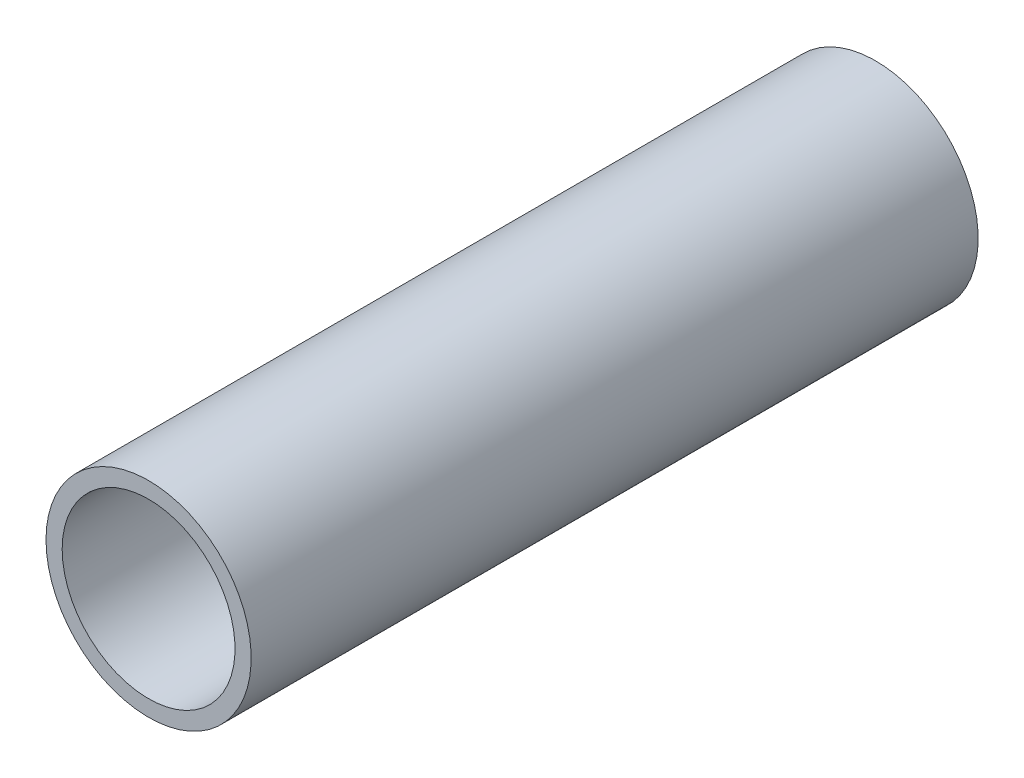
ISO-10303-21;
HEADER;
FILE_DESCRIPTION(('STEP AP214'),'2;1');
FILE_NAME('part.step','',(''),(''),'','','');
FILE_SCHEMA(('AUTOMOTIVE_DESIGN { 1 0 10303 214 1 1 1 1 }'));
ENDSEC;
DATA;
#1=APPLICATION_CONTEXT('core data for automotive mechanical design processes');
#2=APPLICATION_PROTOCOL_DEFINITION('international standard','automotive_design',2000,#1);
#3=PRODUCT_CONTEXT('',#1,'mechanical');
#4=PRODUCT('Part','Part','',(#3));
#5=PRODUCT_RELATED_PRODUCT_CATEGORY('part','',(#4));
#6=PRODUCT_DEFINITION_FORMATION('','',#4);
#7=PRODUCT_DEFINITION_CONTEXT('part definition',#1,'design');
#8=PRODUCT_DEFINITION('design','',#6,#7);
#9=PRODUCT_DEFINITION_SHAPE('','',#8);
#10=(LENGTH_UNIT() NAMED_UNIT(*) SI_UNIT(.MILLI.,.METRE.));
#11=(NAMED_UNIT(*) PLANE_ANGLE_UNIT() SI_UNIT($,.RADIAN.));
#12=(NAMED_UNIT(*) SI_UNIT($,.STERADIAN.) SOLID_ANGLE_UNIT());
#13=UNCERTAINTY_MEASURE_WITH_UNIT(LENGTH_MEASURE(1.E-05),#10,'distance_accuracy_value','');
#14=(GEOMETRIC_REPRESENTATION_CONTEXT(3) GLOBAL_UNCERTAINTY_ASSIGNED_CONTEXT((#13)) GLOBAL_UNIT_ASSIGNED_CONTEXT((#10,
#11,#12)) REPRESENTATION_CONTEXT('',''));
#15=CARTESIAN_POINT('',(0.,0.,0.));
#16=DIRECTION('',(0.,0.,1.));
#17=DIRECTION('',(1.,0.,0.));
#18=AXIS2_PLACEMENT_3D('',#15,#16,#17);
#19=CARTESIAN_POINT('',(0.,0.,-90.));
#20=DIRECTION('',(0.,0.,-1.));
#21=DIRECTION('',(1.,0.,0.));
#22=AXIS2_PLACEMENT_3D('',#19,#20,#21);
#23=PLANE('',#22);
#24=CARTESIAN_POINT('',(0.,0.,-90.));
#25=DIRECTION('',(0.,0.,1.));
#26=DIRECTION('',(1.,0.,0.));
#27=AXIS2_PLACEMENT_3D('',#24,#25,#26);
#28=CIRCLE('',#27,12.7);
#29=CARTESIAN_POINT('',(-12.7,0.,-90.));
#30=VERTEX_POINT('',#29);
#31=EDGE_CURVE('E10',#30,#30,#28,.T.);
#32=ORIENTED_EDGE('',*,*,#31,.F.);
#33=EDGE_LOOP('',(#32));
#34=FACE_BOUND('',#33,.T.);
#35=CARTESIAN_POINT('',(0.,0.,-90.));
#36=DIRECTION('',(0.,0.,1.));
#37=DIRECTION('',(1.,0.,0.));
#38=AXIS2_PLACEMENT_3D('',#35,#36,#37);
#39=CIRCLE('',#38,10.7);
#40=CARTESIAN_POINT('',(-10.7,0.,-90.));
#41=VERTEX_POINT('',#40);
#42=EDGE_CURVE('E44',#41,#41,#39,.T.);
#43=ORIENTED_EDGE('',*,*,#42,.T.);
#44=EDGE_LOOP('',(#43));
#45=FACE_BOUND('',#44,.T.);
#46=ADVANCED_FACE('F33',(#34,#45),#23,.T.);
#47=CARTESIAN_POINT('',(0.,0.,0.));
#48=DIRECTION('',(0.,0.,-1.));
#49=DIRECTION('',(1.,0.,0.));
#50=AXIS2_PLACEMENT_3D('',#47,#48,#49);
#51=PLANE('',#50);
#52=CARTESIAN_POINT('',(0.,0.,0.));
#53=DIRECTION('',(0.,0.,1.));
#54=DIRECTION('',(1.,0.,0.));
#55=AXIS2_PLACEMENT_3D('',#52,#53,#54);
#56=CIRCLE('',#55,12.7);
#57=CARTESIAN_POINT('',(-12.7,0.,0.));
#58=VERTEX_POINT('',#57);
#59=EDGE_CURVE('E37',#58,#58,#56,.T.);
#60=ORIENTED_EDGE('',*,*,#59,.T.);
#61=EDGE_LOOP('',(#60));
#62=FACE_BOUND('',#61,.T.);
#63=CARTESIAN_POINT('',(0.,0.,0.));
#64=DIRECTION('',(0.,0.,1.));
#65=DIRECTION('',(1.,0.,0.));
#66=AXIS2_PLACEMENT_3D('',#63,#64,#65);
#67=CIRCLE('',#66,10.7);
#68=CARTESIAN_POINT('',(-10.7,0.,0.));
#69=VERTEX_POINT('',#68);
#70=EDGE_CURVE('E46',#69,#69,#67,.T.);
#71=ORIENTED_EDGE('',*,*,#70,.F.);
#72=EDGE_LOOP('',(#71));
#73=FACE_BOUND('',#72,.T.);
#74=ADVANCED_FACE('F59',(#62,#73),#51,.F.);
#75=CARTESIAN_POINT('',(0.,0.,-90.));
#76=DIRECTION('',(0.,0.,1.));
#77=DIRECTION('',(-1.,0.,0.));
#78=AXIS2_PLACEMENT_3D('',#75,#76,#77);
#79=CYLINDRICAL_SURFACE('',#78,12.7);
#80=CARTESIAN_POINT('',(-12.7,0.,-90.));
#81=CARTESIAN_POINT('',(-12.7,0.,-89.0625));
#82=CARTESIAN_POINT('',(-12.7,0.,-88.125));
#83=CARTESIAN_POINT('',(-12.7,0.,-86.25));
#84=CARTESIAN_POINT('',(-12.7,0.,-85.3125));
#85=CARTESIAN_POINT('',(-12.7,0.,-83.4375));
#86=CARTESIAN_POINT('',(-12.7,0.,-82.5));
#87=CARTESIAN_POINT('',(-12.7,0.,-80.625));
#88=CARTESIAN_POINT('',(-12.7,0.,-79.6875));
#89=CARTESIAN_POINT('',(-12.7,0.,-77.8125));
#90=CARTESIAN_POINT('',(-12.7,0.,-76.875));
#91=CARTESIAN_POINT('',(-12.7,0.,-75.));
#92=CARTESIAN_POINT('',(-12.7,0.,-74.0625));
#93=CARTESIAN_POINT('',(-12.7,0.,-72.1875));
#94=CARTESIAN_POINT('',(-12.7,0.,-71.25));
#95=CARTESIAN_POINT('',(-12.7,0.,-69.375));
#96=CARTESIAN_POINT('',(-12.7,0.,-68.4375));
#97=CARTESIAN_POINT('',(-12.7,0.,-66.5625));
#98=CARTESIAN_POINT('',(-12.7,0.,-65.625));
#99=CARTESIAN_POINT('',(-12.7,0.,-63.75));
#100=CARTESIAN_POINT('',(-12.7,0.,-62.8125));
#101=CARTESIAN_POINT('',(-12.7,0.,-60.9375));
#102=CARTESIAN_POINT('',(-12.7,0.,-60.));
#103=CARTESIAN_POINT('',(-12.7,0.,-58.125));
#104=CARTESIAN_POINT('',(-12.7,0.,-57.1875));
#105=CARTESIAN_POINT('',(-12.7,0.,-55.3125));
#106=CARTESIAN_POINT('',(-12.7,0.,-54.375));
#107=CARTESIAN_POINT('',(-12.7,0.,-52.5));
#108=CARTESIAN_POINT('',(-12.7,0.,-51.5625));
#109=CARTESIAN_POINT('',(-12.7,0.,-49.6875));
#110=CARTESIAN_POINT('',(-12.7,0.,-48.75));
#111=CARTESIAN_POINT('',(-12.7,0.,-46.875));
#112=CARTESIAN_POINT('',(-12.7,0.,-45.9375));
#113=CARTESIAN_POINT('',(-12.7,0.,-44.0625));
#114=CARTESIAN_POINT('',(-12.7,0.,-43.125));
#115=CARTESIAN_POINT('',(-12.7,0.,-41.25));
#116=CARTESIAN_POINT('',(-12.7,0.,-40.3125));
#117=CARTESIAN_POINT('',(-12.7,0.,-38.4375));
#118=CARTESIAN_POINT('',(-12.7,0.,-37.5));
#119=CARTESIAN_POINT('',(-12.7,0.,-35.625));
#120=CARTESIAN_POINT('',(-12.7,0.,-34.6875));
#121=CARTESIAN_POINT('',(-12.7,0.,-32.8125));
#122=CARTESIAN_POINT('',(-12.7,0.,-31.875));
#123=CARTESIAN_POINT('',(-12.7,0.,-30.));
#124=CARTESIAN_POINT('',(-12.7,0.,-29.0625));
#125=CARTESIAN_POINT('',(-12.7,0.,-27.1875));
#126=CARTESIAN_POINT('',(-12.7,0.,-26.25));
#127=CARTESIAN_POINT('',(-12.7,0.,-24.375));
#128=CARTESIAN_POINT('',(-12.7,0.,-23.4375));
#129=CARTESIAN_POINT('',(-12.7,0.,-21.5625));
#130=CARTESIAN_POINT('',(-12.7,0.,-20.625));
#131=CARTESIAN_POINT('',(-12.7,0.,-18.75));
#132=CARTESIAN_POINT('',(-12.7,0.,-17.8125));
#133=CARTESIAN_POINT('',(-12.7,0.,-15.9375));
#134=CARTESIAN_POINT('',(-12.7,0.,-15.));
#135=CARTESIAN_POINT('',(-12.7,0.,-13.125));
#136=CARTESIAN_POINT('',(-12.7,0.,-12.1875));
#137=CARTESIAN_POINT('',(-12.7,0.,-10.3125));
#138=CARTESIAN_POINT('',(-12.7,0.,-9.37500000000001));
#139=CARTESIAN_POINT('',(-12.7,0.,-7.50000000000002));
#140=CARTESIAN_POINT('',(-12.7,0.,-6.56250000000002));
#141=CARTESIAN_POINT('',(-12.7,0.,-4.68750000000002));
#142=CARTESIAN_POINT('',(-12.7,0.,-3.75000000000001));
#143=CARTESIAN_POINT('',(-12.7,0.,-1.87500000000001));
#144=CARTESIAN_POINT('',(-12.7,0.,-0.937500000000014));
#145=CARTESIAN_POINT('',(-12.7,0.,0.));
#146=B_SPLINE_CURVE_WITH_KNOTS('',3,(#80,#81,#82,#83,#84,#85,#86,#87,#88,#89,#90,#91,#92,#93,
#94,#95,#96,#97,#98,#99,#100,#101,#102,#103,#104,#105,#106,#107,#108,#109,#110,#111,#112,#113,
#114,#115,#116,#117,#118,#119,#120,#121,#122,#123,#124,#125,#126,#127,#128,#129,#130,#131,#132,
#133,#134,#135,#136,#137,#138,#139,#140,#141,#142,#143,#144,#145),.UNSPECIFIED.,.F.,.F.,(4,2,2,
2,2,2,2,2,2,2,2,2,2,2,2,2,2,2,2,2,2,2,2,2,2,2,2,2,2,2,2,2,4),(0.,2.8125,5.62499999999999,
8.43749999999999,11.25,14.0625,16.875,19.6875,22.5,25.3125,28.125,30.9375,33.75,36.5625,39.375,
42.1875,45.,47.8125,50.625,53.4375,56.25,59.0625,61.875,64.6875,67.5,70.3125,73.125,75.9375,
78.75,81.5625,84.375,87.1875,90.),.UNSPECIFIED.);
#147=EDGE_CURVE('BSEAM35',#30,#58,#146,.T.);
#148=ORIENTED_EDGE('',*,*,#31,.T.);
#149=ORIENTED_EDGE('',*,*,#59,.F.);
#150=ORIENTED_EDGE('',*,*,#147,.T.);
#151=ORIENTED_EDGE('',*,*,#147,.F.);
#152=EDGE_LOOP('',(#148,#150,#149,#151));
#153=FACE_BOUND('',#152,.T.);
#154=ADVANCED_FACE('F35',(#153),#79,.T.);
#155=CARTESIAN_POINT('',(0.,0.,-90.));
#156=DIRECTION('',(0.,0.,1.));
#157=DIRECTION('',(-1.,0.,0.));
#158=AXIS2_PLACEMENT_3D('',#155,#156,#157);
#159=CYLINDRICAL_SURFACE('',#158,10.7);
#160=CARTESIAN_POINT('',(-10.7,0.,-90.));
#161=CARTESIAN_POINT('',(-10.7,0.,-89.0625));
#162=CARTESIAN_POINT('',(-10.7,0.,-88.125));
#163=CARTESIAN_POINT('',(-10.7,0.,-86.25));
#164=CARTESIAN_POINT('',(-10.7,0.,-85.3125));
#165=CARTESIAN_POINT('',(-10.7,0.,-83.4375));
#166=CARTESIAN_POINT('',(-10.7,0.,-82.5));
#167=CARTESIAN_POINT('',(-10.7,0.,-80.625));
#168=CARTESIAN_POINT('',(-10.7,0.,-79.6875));
#169=CARTESIAN_POINT('',(-10.7,0.,-77.8125));
#170=CARTESIAN_POINT('',(-10.7,0.,-76.875));
#171=CARTESIAN_POINT('',(-10.7,0.,-75.));
#172=CARTESIAN_POINT('',(-10.7,0.,-74.0625));
#173=CARTESIAN_POINT('',(-10.7,0.,-72.1875));
#174=CARTESIAN_POINT('',(-10.7,0.,-71.25));
#175=CARTESIAN_POINT('',(-10.7,0.,-69.375));
#176=CARTESIAN_POINT('',(-10.7,0.,-68.4375));
#177=CARTESIAN_POINT('',(-10.7,0.,-66.5625));
#178=CARTESIAN_POINT('',(-10.7,0.,-65.625));
#179=CARTESIAN_POINT('',(-10.7,0.,-63.75));
#180=CARTESIAN_POINT('',(-10.7,0.,-62.8125));
#181=CARTESIAN_POINT('',(-10.7,0.,-60.9375));
#182=CARTESIAN_POINT('',(-10.7,0.,-60.));
#183=CARTESIAN_POINT('',(-10.7,0.,-58.125));
#184=CARTESIAN_POINT('',(-10.7,0.,-57.1875));
#185=CARTESIAN_POINT('',(-10.7,0.,-55.3125));
#186=CARTESIAN_POINT('',(-10.7,0.,-54.375));
#187=CARTESIAN_POINT('',(-10.7,0.,-52.5));
#188=CARTESIAN_POINT('',(-10.7,0.,-51.5625));
#189=CARTESIAN_POINT('',(-10.7,0.,-49.6875));
#190=CARTESIAN_POINT('',(-10.7,0.,-48.75));
#191=CARTESIAN_POINT('',(-10.7,0.,-46.875));
#192=CARTESIAN_POINT('',(-10.7,0.,-45.9375));
#193=CARTESIAN_POINT('',(-10.7,0.,-44.0625));
#194=CARTESIAN_POINT('',(-10.7,0.,-43.125));
#195=CARTESIAN_POINT('',(-10.7,0.,-41.25));
#196=CARTESIAN_POINT('',(-10.7,0.,-40.3125));
#197=CARTESIAN_POINT('',(-10.7,0.,-38.4375));
#198=CARTESIAN_POINT('',(-10.7,0.,-37.5));
#199=CARTESIAN_POINT('',(-10.7,0.,-35.625));
#200=CARTESIAN_POINT('',(-10.7,0.,-34.6875));
#201=CARTESIAN_POINT('',(-10.7,0.,-32.8125));
#202=CARTESIAN_POINT('',(-10.7,0.,-31.875));
#203=CARTESIAN_POINT('',(-10.7,0.,-30.));
#204=CARTESIAN_POINT('',(-10.7,0.,-29.0625));
#205=CARTESIAN_POINT('',(-10.7,0.,-27.1875));
#206=CARTESIAN_POINT('',(-10.7,0.,-26.25));
#207=CARTESIAN_POINT('',(-10.7,0.,-24.375));
#208=CARTESIAN_POINT('',(-10.7,0.,-23.4375));
#209=CARTESIAN_POINT('',(-10.7,0.,-21.5625));
#210=CARTESIAN_POINT('',(-10.7,0.,-20.625));
#211=CARTESIAN_POINT('',(-10.7,0.,-18.75));
#212=CARTESIAN_POINT('',(-10.7,0.,-17.8125));
#213=CARTESIAN_POINT('',(-10.7,0.,-15.9375));
#214=CARTESIAN_POINT('',(-10.7,0.,-15.));
#215=CARTESIAN_POINT('',(-10.7,0.,-13.125));
#216=CARTESIAN_POINT('',(-10.7,0.,-12.1875));
#217=CARTESIAN_POINT('',(-10.7,0.,-10.3125));
#218=CARTESIAN_POINT('',(-10.7,0.,-9.37500000000001));
#219=CARTESIAN_POINT('',(-10.7,0.,-7.50000000000002));
#220=CARTESIAN_POINT('',(-10.7,0.,-6.56250000000002));
#221=CARTESIAN_POINT('',(-10.7,0.,-4.68750000000002));
#222=CARTESIAN_POINT('',(-10.7,0.,-3.75000000000001));
#223=CARTESIAN_POINT('',(-10.7,0.,-1.87500000000001));
#224=CARTESIAN_POINT('',(-10.7,0.,-0.937500000000014));
#225=CARTESIAN_POINT('',(-10.7,0.,0.));
#226=B_SPLINE_CURVE_WITH_KNOTS('',3,(#160,#161,#162,#163,#164,#165,#166,#167,#168,#169,#170,
#171,#172,#173,#174,#175,#176,#177,#178,#179,#180,#181,#182,#183,#184,#185,#186,#187,#188,#189,
#190,#191,#192,#193,#194,#195,#196,#197,#198,#199,#200,#201,#202,#203,#204,#205,#206,#207,#208,
#209,#210,#211,#212,#213,#214,#215,#216,#217,#218,#219,#220,#221,#222,#223,#224,#225),
.UNSPECIFIED.,.F.,.F.,(4,2,2,2,2,2,2,2,2,2,2,2,2,2,2,2,2,2,2,2,2,2,2,2,2,2,2,2,2,2,2,2,4),(0.,
2.8125,5.62499999999999,8.43749999999999,11.25,14.0625,16.875,19.6875,22.5,25.3125,28.125,
30.9375,33.75,36.5625,39.375,42.1875,45.,47.8125,50.625,53.4375,56.25,59.0625,61.875,64.6875,
67.5,70.3125,73.125,75.9375,78.75,81.5625,84.375,87.1875,90.),.UNSPECIFIED.);
#227=EDGE_CURVE('BSEAM53',#41,#69,#226,.T.);
#228=ORIENTED_EDGE('',*,*,#42,.F.);
#229=ORIENTED_EDGE('',*,*,#70,.T.);
#230=ORIENTED_EDGE('',*,*,#227,.T.);
#231=ORIENTED_EDGE('',*,*,#227,.F.);
#232=EDGE_LOOP('',(#228,#230,#229,#231));
#233=FACE_BOUND('',#232,.T.);
#234=ADVANCED_FACE('F53',(#233),#159,.F.);
#235=CLOSED_SHELL('',(#46,#74,#154,#234));
#236=MANIFOLD_SOLID_BREP('B2',#235);
#237=ADVANCED_BREP_SHAPE_REPRESENTATION('',(#18,#236),#14);
#238=SHAPE_DEFINITION_REPRESENTATION(#9,#237);
ENDSEC;
END-ISO-10303-21;
